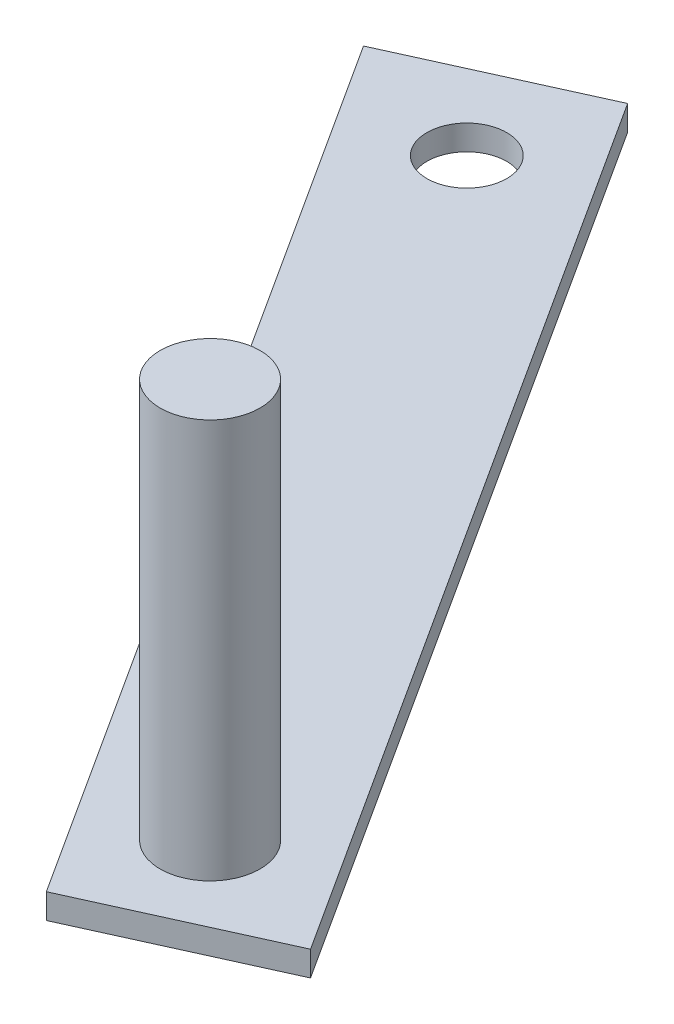
ISO-10303-21;
HEADER;
FILE_DESCRIPTION(('STEP AP214'),'2;1');
FILE_NAME('part.step','',(''),(''),'','','');
FILE_SCHEMA(('AUTOMOTIVE_DESIGN { 1 0 10303 214 1 1 1 1 }'));
ENDSEC;
DATA;
#1=APPLICATION_CONTEXT('core data for automotive mechanical design processes');
#2=APPLICATION_PROTOCOL_DEFINITION('international standard','automotive_design',2000,#1);
#3=PRODUCT_CONTEXT('',#1,'mechanical');
#4=PRODUCT('Part','Part','',(#3));
#5=PRODUCT_RELATED_PRODUCT_CATEGORY('part','',(#4));
#6=PRODUCT_DEFINITION_FORMATION('','',#4);
#7=PRODUCT_DEFINITION_CONTEXT('part definition',#1,'design');
#8=PRODUCT_DEFINITION('design','',#6,#7);
#9=PRODUCT_DEFINITION_SHAPE('','',#8);
#10=(LENGTH_UNIT() NAMED_UNIT(*) SI_UNIT(.MILLI.,.METRE.));
#11=(NAMED_UNIT(*) PLANE_ANGLE_UNIT() SI_UNIT($,.RADIAN.));
#12=(NAMED_UNIT(*) SI_UNIT($,.STERADIAN.) SOLID_ANGLE_UNIT());
#13=UNCERTAINTY_MEASURE_WITH_UNIT(LENGTH_MEASURE(1.E-05),#10,'distance_accuracy_value','');
#14=(GEOMETRIC_REPRESENTATION_CONTEXT(3) GLOBAL_UNCERTAINTY_ASSIGNED_CONTEXT((#13)) GLOBAL_UNIT_ASSIGNED_CONTEXT((#10,
#11,#12)) REPRESENTATION_CONTEXT('',''));
#15=CARTESIAN_POINT('',(0.,0.,0.));
#16=DIRECTION('',(0.,0.,1.));
#17=DIRECTION('',(1.,0.,0.));
#18=AXIS2_PLACEMENT_3D('',#15,#16,#17);
#19=CARTESIAN_POINT('',(0.,3.175,0.));
#20=DIRECTION('',(0.,-1.,0.));
#21=DIRECTION('',(0.,0.,-1.));
#22=AXIS2_PLACEMENT_3D('',#19,#20,#21);
#23=PLANE('',#22);
#24=CARTESIAN_POINT('',(-50.6960948511983,3.175,24.181527026121));
#25=DIRECTION('',(0.,-1.,0.));
#26=DIRECTION('',(0.,0.,-1.));
#27=AXIS2_PLACEMENT_3D('',#24,#25,#26);
#28=CIRCLE('',#27,6.35);
#29=CARTESIAN_POINT('',(-50.6960948511983,3.175,17.831527026121));
#30=VERTEX_POINT('',#29);
#31=EDGE_CURVE('E11',#30,#30,#28,.F.);
#32=ORIENTED_EDGE('',*,*,#31,.F.);
#33=EDGE_LOOP('',(#32));
#34=FACE_BOUND('',#33,.T.);
#35=DIRECTION('',(-0.91105944434931,0.,0.412275016053516));
#36=VECTOR('',#35,1.);
#37=CARTESIAN_POINT('',(-128.460753108732,3.175,-73.1009565929248));
#38=LINE('',#37,#36);
#39=CARTESIAN_POINT('',(-105.319843222259,3.175,-83.5727420006842));
#40=VERTEX_POINT('',#39);
#41=CARTESIAN_POINT('',(-128.460753108732,3.175,-73.1009565929248));
#42=VERTEX_POINT('',#41);
#43=EDGE_CURVE('E87',#40,#42,#38,.T.);
#44=ORIENTED_EDGE('',*,*,#43,.T.);
#45=DIRECTION('',(0.5414887466698,0.,0.840707997600813));
#46=VECTOR('',#45,1.);
#47=CARTESIAN_POINT('',(-55.4409956203092,3.175,40.2685168835448));
#48=LINE('',#47,#46);
#49=CARTESIAN_POINT('',(-55.4409956203092,3.175,40.2685168835448));
#50=VERTEX_POINT('',#49);
#51=EDGE_CURVE('E82',#42,#50,#48,.T.);
#52=ORIENTED_EDGE('',*,*,#51,.T.);
#53=DIRECTION('',(0.91105944434931,0.,-0.412275016053516));
#54=VECTOR('',#53,1.);
#55=CARTESIAN_POINT('',(-32.3000857338367,3.175,29.7967314757855));
#56=LINE('',#55,#54);
#57=CARTESIAN_POINT('',(-32.3000857338367,3.175,29.7967314757855));
#58=VERTEX_POINT('',#57);
#59=EDGE_CURVE('E85',#50,#58,#56,.T.);
#60=ORIENTED_EDGE('',*,*,#59,.T.);
#61=DIRECTION('',(-0.5414887466698,0.,-0.840707997600813));
#62=VECTOR('',#61,1.);
#63=CARTESIAN_POINT('',(-105.319843222259,3.175,-83.5727420006842));
#64=LINE('',#63,#62);
#65=EDGE_CURVE('E51',#58,#40,#64,.T.);
#66=ORIENTED_EDGE('',*,*,#65,.T.);
#67=EDGE_LOOP('',(#44,#52,#60,#66));
#68=FACE_BOUND('',#67,.T.);
#69=CARTESIAN_POINT('',(-109.811555344914,3.175,-67.6003257354992));
#70=DIRECTION('',(0.,1.,0.));
#71=DIRECTION('',(0.,0.,1.));
#72=AXIS2_PLACEMENT_3D('',#69,#70,#71);
#73=CIRCLE('',#72,5.07829890335643);
#74=CARTESIAN_POINT('',(-109.811555344914,3.175,-62.5220268321427));
#75=VERTEX_POINT('',#74);
#76=EDGE_CURVE('E104',#75,#75,#73,.T.);
#77=ORIENTED_EDGE('',*,*,#76,.F.);
#78=EDGE_LOOP('',(#77));
#79=FACE_BOUND('',#78,.T.);
#80=ADVANCED_FACE('F34',(#34,#68,#79),#23,.F.);
#81=CARTESIAN_POINT('',(0.,0.,0.));
#82=DIRECTION('',(0.,-1.,0.));
#83=DIRECTION('',(0.,0.,-1.));
#84=AXIS2_PLACEMENT_3D('',#81,#82,#83);
#85=PLANE('',#84);
#86=DIRECTION('',(-0.91105944434931,0.,0.412275016053516));
#87=VECTOR('',#86,1.);
#88=CARTESIAN_POINT('',(-128.460753108732,0.,-73.1009565929248));
#89=LINE('',#88,#87);
#90=CARTESIAN_POINT('',(-105.319843222259,0.,-83.5727420006842));
#91=VERTEX_POINT('',#90);
#92=CARTESIAN_POINT('',(-128.460753108732,0.,-73.1009565929248));
#93=VERTEX_POINT('',#92);
#94=EDGE_CURVE('E101',#91,#93,#89,.T.);
#95=ORIENTED_EDGE('',*,*,#94,.F.);
#96=DIRECTION('',(-0.5414887466698,0.,-0.840707997600813));
#97=VECTOR('',#96,1.);
#98=CARTESIAN_POINT('',(-105.319843222259,0.,-83.5727420006842));
#99=LINE('',#98,#97);
#100=CARTESIAN_POINT('',(-32.3000857338367,0.,29.7967314757855));
#101=VERTEX_POINT('',#100);
#102=EDGE_CURVE('E74',#101,#91,#99,.T.);
#103=ORIENTED_EDGE('',*,*,#102,.F.);
#104=DIRECTION('',(0.91105944434931,0.,-0.412275016053516));
#105=VECTOR('',#104,1.);
#106=CARTESIAN_POINT('',(-32.3000857338367,0.,29.7967314757855));
#107=LINE('',#106,#105);
#108=CARTESIAN_POINT('',(-55.4409956203092,0.,40.2685168835448));
#109=VERTEX_POINT('',#108);
#110=EDGE_CURVE('E68',#109,#101,#107,.T.);
#111=ORIENTED_EDGE('',*,*,#110,.F.);
#112=DIRECTION('',(0.5414887466698,0.,0.840707997600813));
#113=VECTOR('',#112,1.);
#114=CARTESIAN_POINT('',(-55.4409956203092,0.,40.2685168835448));
#115=LINE('',#114,#113);
#116=EDGE_CURVE('E92',#93,#109,#115,.T.);
#117=ORIENTED_EDGE('',*,*,#116,.F.);
#118=EDGE_LOOP('',(#95,#103,#111,#117));
#119=FACE_BOUND('',#118,.T.);
#120=CARTESIAN_POINT('',(-109.811555344914,0.,-67.6003257354992));
#121=DIRECTION('',(0.,1.,0.));
#122=DIRECTION('',(0.,0.,1.));
#123=AXIS2_PLACEMENT_3D('',#120,#121,#122);
#124=CIRCLE('',#123,5.07829890335643);
#125=CARTESIAN_POINT('',(-109.811555344914,0.,-62.5220268321427));
#126=VERTEX_POINT('',#125);
#127=EDGE_CURVE('E118',#126,#126,#124,.T.);
#128=ORIENTED_EDGE('',*,*,#127,.T.);
#129=EDGE_LOOP('',(#128));
#130=FACE_BOUND('',#129,.T.);
#131=ADVANCED_FACE('F112',(#119,#130),#85,.T.);
#132=CARTESIAN_POINT('',(-128.460753108732,3.175,-73.1009565929248));
#133=DIRECTION('',(0.412275016053516,0.,0.91105944434931));
#134=DIRECTION('',(0.91105944434931,0.,-0.412275016053516));
#135=AXIS2_PLACEMENT_3D('',#132,#133,#134);
#136=PLANE('',#135);
#137=ORIENTED_EDGE('',*,*,#94,.T.);
#138=DIRECTION('',(0.,-1.,0.));
#139=VECTOR('',#138,1.);
#140=CARTESIAN_POINT('',(-128.460753108732,3.175,-73.1009565929248));
#141=LINE('',#140,#139);
#142=EDGE_CURVE('E43',#42,#93,#141,.T.);
#143=ORIENTED_EDGE('',*,*,#142,.F.);
#144=ORIENTED_EDGE('',*,*,#43,.F.);
#145=DIRECTION('',(0.,-1.,0.));
#146=VECTOR('',#145,1.);
#147=CARTESIAN_POINT('',(-105.319843222259,3.175,-83.5727420006842));
#148=LINE('',#147,#146);
#149=EDGE_CURVE('E97',#40,#91,#148,.T.);
#150=ORIENTED_EDGE('',*,*,#149,.T.);
#151=EDGE_LOOP('',(#137,#143,#144,#150));
#152=FACE_BOUND('',#151,.T.);
#153=ADVANCED_FACE('F36',(#152),#136,.F.);
#154=CARTESIAN_POINT('',(-55.4409956203092,3.175,40.2685168835448));
#155=DIRECTION('',(0.840707997600813,0.,-0.5414887466698));
#156=DIRECTION('',(-0.5414887466698,0.,-0.840707997600814));
#157=AXIS2_PLACEMENT_3D('',#154,#155,#156);
#158=PLANE('',#157);
#159=ORIENTED_EDGE('',*,*,#116,.T.);
#160=DIRECTION('',(0.,-1.,0.));
#161=VECTOR('',#160,1.);
#162=CARTESIAN_POINT('',(-55.4409956203092,3.175,40.2685168835448));
#163=LINE('',#162,#161);
#164=EDGE_CURVE('E90',#50,#109,#163,.T.);
#165=ORIENTED_EDGE('',*,*,#164,.F.);
#166=ORIENTED_EDGE('',*,*,#51,.F.);
#167=ORIENTED_EDGE('',*,*,#142,.T.);
#168=EDGE_LOOP('',(#159,#165,#166,#167));
#169=FACE_BOUND('',#168,.T.);
#170=ADVANCED_FACE('F91',(#169),#158,.F.);
#171=CARTESIAN_POINT('',(-32.3000857338367,3.175,29.7967314757855));
#172=DIRECTION('',(-0.412275016053516,0.,-0.91105944434931));
#173=DIRECTION('',(-0.91105944434931,0.,0.412275016053516));
#174=AXIS2_PLACEMENT_3D('',#171,#172,#173);
#175=PLANE('',#174);
#176=ORIENTED_EDGE('',*,*,#110,.T.);
#177=DIRECTION('',(0.,-1.,0.));
#178=VECTOR('',#177,1.);
#179=CARTESIAN_POINT('',(-32.3000857338367,3.175,29.7967314757855));
#180=LINE('',#179,#178);
#181=EDGE_CURVE('E93',#58,#101,#180,.T.);
#182=ORIENTED_EDGE('',*,*,#181,.F.);
#183=ORIENTED_EDGE('',*,*,#59,.F.);
#184=ORIENTED_EDGE('',*,*,#164,.T.);
#185=EDGE_LOOP('',(#176,#182,#183,#184));
#186=FACE_BOUND('',#185,.T.);
#187=ADVANCED_FACE('F95',(#186),#175,.F.);
#188=CARTESIAN_POINT('',(-105.319843222259,3.175,-83.5727420006842));
#189=DIRECTION('',(-0.840707997600813,0.,0.5414887466698));
#190=DIRECTION('',(0.5414887466698,0.,0.840707997600813));
#191=AXIS2_PLACEMENT_3D('',#188,#189,#190);
#192=PLANE('',#191);
#193=ORIENTED_EDGE('',*,*,#102,.T.);
#194=ORIENTED_EDGE('',*,*,#149,.F.);
#195=ORIENTED_EDGE('',*,*,#65,.F.);
#196=ORIENTED_EDGE('',*,*,#181,.T.);
#197=EDGE_LOOP('',(#193,#194,#195,#196));
#198=FACE_BOUND('',#197,.T.);
#199=ADVANCED_FACE('F143',(#198),#192,.F.);
#200=CARTESIAN_POINT('',(-109.811555344914,3.175,-67.6003257354992));
#201=DIRECTION('',(0.,-1.,0.));
#202=DIRECTION('',(0.,0.,-1.));
#203=AXIS2_PLACEMENT_3D('',#200,#201,#202);
#204=CYLINDRICAL_SURFACE('',#203,5.07829890335643);
#205=ORIENTED_EDGE('',*,*,#76,.T.);
#206=EDGE_LOOP('',(#205));
#207=FACE_BOUND('',#206,.T.);
#208=ORIENTED_EDGE('',*,*,#127,.F.);
#209=EDGE_LOOP('',(#208));
#210=FACE_BOUND('',#209,.T.);
#211=ADVANCED_FACE('F133',(#207,#210),#204,.F.);
#212=CARTESIAN_POINT('',(-50.6960948511983,53.975,24.181527026121));
#213=DIRECTION('',(0.,-1.,0.));
#214=DIRECTION('',(0.,0.,-1.));
#215=AXIS2_PLACEMENT_3D('',#212,#213,#214);
#216=CYLINDRICAL_SURFACE('',#215,6.35);
#217=CARTESIAN_POINT('',(-50.6960948511983,53.975,24.181527026121));
#218=DIRECTION('',(0.,1.,0.));
#219=DIRECTION('',(0.,0.,1.));
#220=AXIS2_PLACEMENT_3D('',#217,#218,#219);
#221=CIRCLE('',#220,6.35);
#222=CARTESIAN_POINT('',(-50.6960948511983,53.975,30.531527026121));
#223=VERTEX_POINT('',#222);
#224=EDGE_CURVE('E120',#223,#223,#221,.T.);
#225=ORIENTED_EDGE('',*,*,#224,.F.);
#226=EDGE_LOOP('',(#225));
#227=FACE_BOUND('',#226,.T.);
#228=ORIENTED_EDGE('',*,*,#31,.T.);
#229=EDGE_LOOP('',(#228));
#230=FACE_BOUND('',#229,.T.);
#231=ADVANCED_FACE('F130',(#227,#230),#216,.T.);
#232=CARTESIAN_POINT('',(-50.6960948511983,53.975,24.181527026121));
#233=DIRECTION('',(0.,1.,0.));
#234=DIRECTION('',(0.,0.,1.));
#235=AXIS2_PLACEMENT_3D('',#232,#233,#234);
#236=PLANE('',#235);
#237=ORIENTED_EDGE('',*,*,#224,.T.);
#238=EDGE_LOOP('',(#237));
#239=FACE_BOUND('',#238,.T.);
#240=ADVANCED_FACE('F128',(#239),#236,.T.);
#241=CLOSED_SHELL('',(#80,#131,#153,#170,#187,#199,#211,#231,#240));
#242=MANIFOLD_SOLID_BREP('B2',#241);
#243=ADVANCED_BREP_SHAPE_REPRESENTATION('',(#18,#242),#14);
#244=SHAPE_DEFINITION_REPRESENTATION(#9,#243);
ENDSEC;
END-ISO-10303-21;
